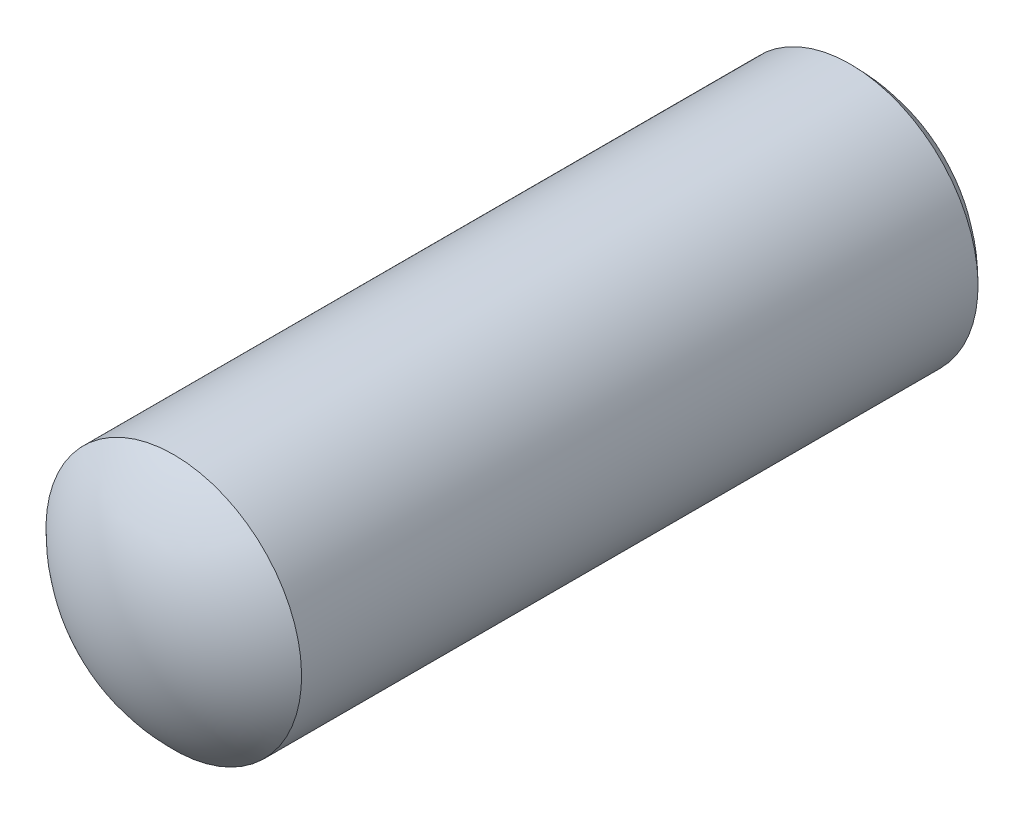
ISO-10303-21;
HEADER;
FILE_DESCRIPTION(('STEP AP214'),'2;1');
FILE_NAME('part.step','',(''),(''),'','','');
FILE_SCHEMA(('AUTOMOTIVE_DESIGN { 1 0 10303 214 1 1 1 1 }'));
ENDSEC;
DATA;
#1=APPLICATION_CONTEXT('core data for automotive mechanical design processes');
#2=APPLICATION_PROTOCOL_DEFINITION('international standard','automotive_design',2000,#1);
#3=PRODUCT_CONTEXT('',#1,'mechanical');
#4=PRODUCT('Part','Part','',(#3));
#5=PRODUCT_RELATED_PRODUCT_CATEGORY('part','',(#4));
#6=PRODUCT_DEFINITION_FORMATION('','',#4);
#7=PRODUCT_DEFINITION_CONTEXT('part definition',#1,'design');
#8=PRODUCT_DEFINITION('design','',#6,#7);
#9=PRODUCT_DEFINITION_SHAPE('','',#8);
#10=(LENGTH_UNIT() NAMED_UNIT(*) SI_UNIT(.MILLI.,.METRE.));
#11=(NAMED_UNIT(*) PLANE_ANGLE_UNIT() SI_UNIT($,.RADIAN.));
#12=(NAMED_UNIT(*) SI_UNIT($,.STERADIAN.) SOLID_ANGLE_UNIT());
#13=UNCERTAINTY_MEASURE_WITH_UNIT(LENGTH_MEASURE(1.E-05),#10,'distance_accuracy_value','');
#14=(GEOMETRIC_REPRESENTATION_CONTEXT(3) GLOBAL_UNCERTAINTY_ASSIGNED_CONTEXT((#13)) GLOBAL_UNIT_ASSIGNED_CONTEXT((#10,
#11,#12)) REPRESENTATION_CONTEXT('',''));
#15=CARTESIAN_POINT('',(0.,0.,0.));
#16=DIRECTION('',(0.,0.,1.));
#17=DIRECTION('',(1.,0.,0.));
#18=AXIS2_PLACEMENT_3D('',#15,#16,#17);
#19=CARTESIAN_POINT('',(0.,-9.125,7.875));
#20=DIRECTION('',(-1.,0.,0.));
#21=DIRECTION('',(0.,0.,1.));
#22=AXIS2_PLACEMENT_3D('',#19,#20,#21);
#23=SPHERICAL_SURFACE('',#22,1.575);
#24=CARTESIAN_POINT('',(0.,-9.125,7.875));
#25=DIRECTION('',(0.,0.,1.));
#26=DIRECTION('',(0.,1.,0.));
#27=AXIS2_PLACEMENT_3D('',#24,#25,#26);
#28=SPHERICAL_SURFACE('',#27,1.575);
#29=CARTESIAN_POINT('',(0.,-9.125,8.97727038425245));
#30=DIRECTION('',(0.,0.,1.));
#31=DIRECTION('',(0.,1.,0.));
#32=AXIS2_PLACEMENT_3D('',#29,#30,#31);
#33=CIRCLE('',#32,1.125);
#34=CARTESIAN_POINT('',(0.,-8.,8.97727038425245));
#35=VERTEX_POINT('',#34);
#36=EDGE_CURVE('E11',#35,#35,#33,.T.);
#37=ORIENTED_EDGE('',*,*,#36,.T.);
#38=EDGE_LOOP('',(#37));
#39=FACE_BOUND('',#38,.T.);
#40=ADVANCED_FACE('F17',(#39),#28,.T.);
#41=CARTESIAN_POINT('',(0.,-9.125,6.));
#42=DIRECTION('',(0.,0.,1.));
#43=DIRECTION('',(0.,1.,0.));
#44=AXIS2_PLACEMENT_3D('',#41,#42,#43);
#45=CYLINDRICAL_SURFACE('',#44,1.125);
#46=CARTESIAN_POINT('',(0.,-9.125,3.02272961574759));
#47=DIRECTION('',(0.,0.,1.));
#48=DIRECTION('',(0.,1.,0.));
#49=AXIS2_PLACEMENT_3D('',#46,#47,#48);
#50=CIRCLE('',#49,1.125);
#51=CARTESIAN_POINT('',(0.,-8.,3.02272961574759));
#52=VERTEX_POINT('',#51);
#53=EDGE_CURVE('E27',#52,#52,#50,.T.);
#54=ORIENTED_EDGE('',*,*,#53,.T.);
#55=EDGE_LOOP('',(#54));
#56=FACE_BOUND('',#55,.T.);
#57=ORIENTED_EDGE('',*,*,#36,.F.);
#58=EDGE_LOOP('',(#57));
#59=FACE_BOUND('',#58,.T.);
#60=ADVANCED_FACE('F19',(#56,#59),#45,.T.);
#61=CARTESIAN_POINT('',(0.,-9.125,4.125));
#62=DIRECTION('',(-1.,0.,0.));
#63=DIRECTION('',(0.,0.,-1.));
#64=AXIS2_PLACEMENT_3D('',#61,#62,#63);
#65=SPHERICAL_SURFACE('',#64,1.575);
#66=CARTESIAN_POINT('',(0.,-9.125,4.125));
#67=DIRECTION('',(0.,0.,1.));
#68=DIRECTION('',(0.,1.,0.));
#69=AXIS2_PLACEMENT_3D('',#66,#67,#68);
#70=SPHERICAL_SURFACE('',#69,1.575);
#71=ORIENTED_EDGE('',*,*,#53,.F.);
#72=EDGE_LOOP('',(#71));
#73=FACE_BOUND('',#72,.T.);
#74=ADVANCED_FACE('F57',(#73),#70,.T.);
#75=CLOSED_SHELL('',(#40,#60,#74));
#76=MANIFOLD_SOLID_BREP('B1',#75);
#77=ADVANCED_BREP_SHAPE_REPRESENTATION('',(#18,#76),#14);
#78=SHAPE_DEFINITION_REPRESENTATION(#9,#77);
ENDSEC;
END-ISO-10303-21;
